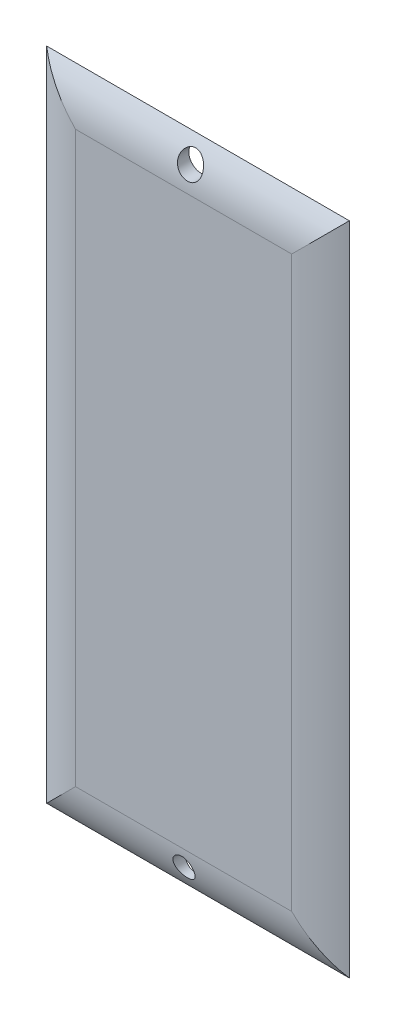
ISO-10303-21;
HEADER;
FILE_DESCRIPTION(('STEP AP214'),'2;1');
FILE_NAME('part.step','',(''),(''),'','','');
FILE_SCHEMA(('AUTOMOTIVE_DESIGN { 1 0 10303 214 1 1 1 1 }'));
ENDSEC;
DATA;
#1=APPLICATION_CONTEXT('core data for automotive mechanical design processes');
#2=APPLICATION_PROTOCOL_DEFINITION('international standard','automotive_design',2000,#1);
#3=PRODUCT_CONTEXT('',#1,'mechanical');
#4=PRODUCT('Part','Part','',(#3));
#5=PRODUCT_RELATED_PRODUCT_CATEGORY('part','',(#4));
#6=PRODUCT_DEFINITION_FORMATION('','',#4);
#7=PRODUCT_DEFINITION_CONTEXT('part definition',#1,'design');
#8=PRODUCT_DEFINITION('design','',#6,#7);
#9=PRODUCT_DEFINITION_SHAPE('','',#8);
#10=(LENGTH_UNIT() NAMED_UNIT(*) SI_UNIT(.MILLI.,.METRE.));
#11=(NAMED_UNIT(*) PLANE_ANGLE_UNIT() SI_UNIT($,.RADIAN.));
#12=(NAMED_UNIT(*) SI_UNIT($,.STERADIAN.) SOLID_ANGLE_UNIT());
#13=UNCERTAINTY_MEASURE_WITH_UNIT(LENGTH_MEASURE(1.E-05),#10,'distance_accuracy_value','');
#14=(GEOMETRIC_REPRESENTATION_CONTEXT(3) GLOBAL_UNCERTAINTY_ASSIGNED_CONTEXT((#13)) GLOBAL_UNIT_ASSIGNED_CONTEXT((#10,
#11,#12)) REPRESENTATION_CONTEXT('',''));
#15=CARTESIAN_POINT('',(0.,0.,0.));
#16=DIRECTION('',(0.,0.,1.));
#17=DIRECTION('',(1.,0.,0.));
#18=AXIS2_PLACEMENT_3D('',#15,#16,#17);
#19=CARTESIAN_POINT('',(0.,0.,2.));
#20=DIRECTION('',(0.,0.,1.));
#21=DIRECTION('',(1.,0.,0.));
#22=AXIS2_PLACEMENT_3D('',#19,#20,#21);
#23=PLANE('',#22);
#24=DIRECTION('',(0.,-1.,0.));
#25=VECTOR('',#24,1.);
#26=CARTESIAN_POINT('',(15.,45.5,2.));
#27=LINE('',#26,#25);
#28=CARTESIAN_POINT('',(15.,-39.5,2.));
#29=VERTEX_POINT('',#28);
#30=CARTESIAN_POINT('',(15.,39.5,2.));
#31=VERTEX_POINT('',#30);
#32=EDGE_CURVE('E67',#29,#31,#27,.F.);
#33=ORIENTED_EDGE('',*,*,#32,.T.);
#34=DIRECTION('',(1.,0.,0.));
#35=VECTOR('',#34,1.);
#36=CARTESIAN_POINT('',(-21.,39.5,2.));
#37=LINE('',#36,#35);
#38=CARTESIAN_POINT('',(-15.,39.5,2.));
#39=VERTEX_POINT('',#38);
#40=EDGE_CURVE('E11',#31,#39,#37,.F.);
#41=ORIENTED_EDGE('',*,*,#40,.T.);
#42=DIRECTION('',(0.,1.,0.));
#43=VECTOR('',#42,1.);
#44=CARTESIAN_POINT('',(-15.,-45.5,2.));
#45=LINE('',#44,#43);
#46=CARTESIAN_POINT('',(-15.,-39.5,2.));
#47=VERTEX_POINT('',#46);
#48=EDGE_CURVE('E52',#39,#47,#45,.F.);
#49=ORIENTED_EDGE('',*,*,#48,.T.);
#50=DIRECTION('',(-1.,0.,0.));
#51=VECTOR('',#50,1.);
#52=CARTESIAN_POINT('',(21.,-39.5,2.));
#53=LINE('',#52,#51);
#54=EDGE_CURVE('E103',#47,#29,#53,.F.);
#55=ORIENTED_EDGE('',*,*,#54,.T.);
#56=EDGE_LOOP('',(#33,#41,#49,#55));
#57=FACE_BOUND('',#56,.T.);
#58=ADVANCED_FACE('F38',(#57),#23,.T.);
#59=CARTESIAN_POINT('',(0.,0.,0.));
#60=DIRECTION('',(0.,0.,1.));
#61=DIRECTION('',(1.,0.,0.));
#62=AXIS2_PLACEMENT_3D('',#59,#60,#61);
#63=PLANE('',#62);
#64=CARTESIAN_POINT('',(-0.283052715511412,-42.0494382228283,0.));
#65=DIRECTION('',(0.,0.,1.));
#66=DIRECTION('',(1.,0.,0.));
#67=AXIS2_PLACEMENT_3D('',#64,#65,#66);
#68=CIRCLE('',#67,1.49229187540514);
#69=CARTESIAN_POINT('',(1.20923915989373,-42.0494382228283,0.));
#70=VERTEX_POINT('',#69);
#71=EDGE_CURVE('E109',#70,#70,#68,.T.);
#72=ORIENTED_EDGE('',*,*,#71,.T.);
#73=EDGE_LOOP('',(#72));
#74=FACE_BOUND('',#73,.T.);
#75=CARTESIAN_POINT('',(0.438366209458385,42.6370445816459,0.));
#76=DIRECTION('',(0.,0.,1.));
#77=DIRECTION('',(1.,0.,0.));
#78=AXIS2_PLACEMENT_3D('',#75,#76,#77);
#79=CIRCLE('',#78,1.71386303997088);
#80=CARTESIAN_POINT('',(2.15222924942926,42.6370445816459,0.));
#81=VERTEX_POINT('',#80);
#82=EDGE_CURVE('E114',#81,#81,#79,.T.);
#83=ORIENTED_EDGE('',*,*,#82,.T.);
#84=EDGE_LOOP('',(#83));
#85=FACE_BOUND('',#84,.T.);
#86=DIRECTION('',(0.,-1.,0.));
#87=VECTOR('',#86,1.);
#88=CARTESIAN_POINT('',(-21.,45.5,0.));
#89=LINE('',#88,#87);
#90=CARTESIAN_POINT('',(-21.,45.5,0.));
#91=VERTEX_POINT('',#90);
#92=CARTESIAN_POINT('',(-21.,-45.5,0.));
#93=VERTEX_POINT('',#92);
#94=EDGE_CURVE('E92',#91,#93,#89,.T.);
#95=ORIENTED_EDGE('',*,*,#94,.F.);
#96=DIRECTION('',(-1.,0.,0.));
#97=VECTOR('',#96,1.);
#98=CARTESIAN_POINT('',(-21.,45.5,0.));
#99=LINE('',#98,#97);
#100=CARTESIAN_POINT('',(21.,45.5,0.));
#101=VERTEX_POINT('',#100);
#102=EDGE_CURVE('E117',#101,#91,#99,.T.);
#103=ORIENTED_EDGE('',*,*,#102,.F.);
#104=DIRECTION('',(0.,1.,0.));
#105=VECTOR('',#104,1.);
#106=CARTESIAN_POINT('',(21.,45.5,0.));
#107=LINE('',#106,#105);
#108=CARTESIAN_POINT('',(21.,-45.5,0.));
#109=VERTEX_POINT('',#108);
#110=EDGE_CURVE('E94',#109,#101,#107,.T.);
#111=ORIENTED_EDGE('',*,*,#110,.F.);
#112=DIRECTION('',(1.,0.,0.));
#113=VECTOR('',#112,1.);
#114=CARTESIAN_POINT('',(-21.,-45.5,0.));
#115=LINE('',#114,#113);
#116=EDGE_CURVE('E87',#93,#109,#115,.T.);
#117=ORIENTED_EDGE('',*,*,#116,.F.);
#118=EDGE_LOOP('',(#95,#103,#111,#117));
#119=FACE_BOUND('',#118,.T.);
#120=ADVANCED_FACE('F89',(#74,#85,#119),#63,.F.);
#121=CARTESIAN_POINT('',(0.438366209458385,42.6370445816459,0.));
#122=DIRECTION('',(0.,0.,1.));
#123=DIRECTION('',(1.,0.,0.));
#124=AXIS2_PLACEMENT_3D('',#121,#122,#123);
#125=CYLINDRICAL_SURFACE('',#124,1.71386303997088);
#126=ORIENTED_EDGE('',*,*,#82,.F.);
#127=EDGE_LOOP('',(#126));
#128=FACE_BOUND('',#127,.T.);
#129=CARTESIAN_POINT('',(-1.2694880907903,42.49365626657,1.54138470860631));
#130=CARTESIAN_POINT('',(-1.26153018198372,42.3989003218355,1.57111384004396));
#131=CARTESIAN_POINT('',(-1.24562674473768,42.3042736289645,1.59923958893455));
#132=CARTESIAN_POINT('',(-1.19784045575203,42.1180053628231,1.65170559677611));
#133=CARTESIAN_POINT('',(-1.16595267523963,42.0263647195894,1.67604468507495));
#134=CARTESIAN_POINT('',(-1.08659773410087,41.8488337860684,1.72066739622117));
#135=CARTESIAN_POINT('',(-1.03910709419893,41.7629523983206,1.74094483258807));
#136=CARTESIAN_POINT('',(-0.929651207582571,41.5999882520282,1.77737345788032));
#137=CARTESIAN_POINT('',(-0.86768808590962,41.5229042042127,1.79352525185888));
#138=CARTESIAN_POINT('',(-0.732954614655891,41.3822344647596,1.82151732909178));
#139=CARTESIAN_POINT('',(-0.660544273149174,41.3183256211037,1.83346776620229));
#140=CARTESIAN_POINT('',(-0.505711061498358,41.2033996276326,1.85402702834544));
#141=CARTESIAN_POINT('',(-0.423288888879885,41.1523815804759,1.86263608599733));
#142=CARTESIAN_POINT('',(-0.252098142701079,41.0655280646701,1.87679292465461));
#143=CARTESIAN_POINT('',(-0.163440641072006,41.0294804846171,1.88238383624199));
#144=CARTESIAN_POINT('',(0.0187466424635544,40.972607127221,1.89101925940345));
#145=CARTESIAN_POINT('',(0.11227633881088,40.9517810826734,1.8940638156773));
#146=CARTESIAN_POINT('',(0.301370181452164,40.9260075112518,1.89781160832244));
#147=CARTESIAN_POINT('',(0.396930332548865,40.9210312696718,1.89851907882222));
#148=CARTESIAN_POINT('',(0.58753921955667,40.9270253792902,1.89765664622265));
#149=CARTESIAN_POINT('',(0.682587955224736,40.9379957380661,1.89608674204115));
#150=CARTESIAN_POINT('',(0.869505947366675,40.9755588031411,1.89055521491518));
#151=CARTESIAN_POINT('',(0.961374202697005,41.0021563820317,1.88659284598582));
#152=CARTESIAN_POINT('',(1.13928806277195,41.0701673604568,1.87601899644375));
#153=CARTESIAN_POINT('',(1.22533377348076,41.1115804902775,1.86940756405638));
#154=CARTESIAN_POINT('',(1.38913760455742,41.2079242029855,1.85319086006218));
#155=CARTESIAN_POINT('',(1.46689868867383,41.2628499284397,1.84358666394745));
#156=CARTESIAN_POINT('',(1.61200060169092,41.3844984502633,1.82102240456898));
#157=CARTESIAN_POINT('',(1.67934174291585,41.4512208929129,1.80806244192111));
#158=CARTESIAN_POINT('',(1.80196287016079,41.5945258782606,1.77846182958802));
#159=CARTESIAN_POINT('',(1.85721324149649,41.6711319165247,1.76181233910156));
#160=CARTESIAN_POINT('',(1.954111038298,41.8316648684332,1.72471688287746));
#161=CARTESIAN_POINT('',(1.99575792692562,41.9155920708293,1.70427076736242));
#162=CARTESIAN_POINT('',(2.06519294481537,42.0896152303449,1.65930074391825));
#163=CARTESIAN_POINT('',(2.09274693022936,42.1797888003737,1.63471643331315));
#164=CARTESIAN_POINT('',(2.13266823341674,42.3624329181035,1.58204131676535));
#165=CARTESIAN_POINT('',(2.14503280255299,42.4549038784464,1.55394987719461));
#166=CARTESIAN_POINT('',(2.15491875783667,42.6434274238081,1.49363186782823));
#167=CARTESIAN_POINT('',(2.15181871363539,42.7394733890218,1.46128390218905));
#168=CARTESIAN_POINT('',(2.12988442949902,42.9289258695292,1.39428427636494));
#169=CARTESIAN_POINT('',(2.11104561916391,43.0223316099784,1.35963194970434));
#170=CARTESIAN_POINT('',(2.0569181324665,43.2094267635442,1.28712916463769));
#171=CARTESIAN_POINT('',(2.02076920758398,43.3028404641393,1.24920819231005));
#172=CARTESIAN_POINT('',(1.93277806443218,43.4820486341403,1.17348166929994));
#173=CARTESIAN_POINT('',(1.88093008047817,43.5678402892522,1.1356761661864));
#174=CARTESIAN_POINT('',(1.76082185156981,43.7320776706837,1.06078967604263));
#175=CARTESIAN_POINT('',(1.69211158125293,43.8102217341544,1.02376542685404));
#176=CARTESIAN_POINT('',(1.54053423131094,43.9536421506632,0.95385092818028));
#177=CARTESIAN_POINT('',(1.45766921186868,44.0189203733134,0.920960078298266));
#178=CARTESIAN_POINT('',(1.28399905156737,44.1311637933591,0.863189273794485));
#179=CARTESIAN_POINT('',(1.19377790371136,44.1788665966893,0.837996961731));
#180=CARTESIAN_POINT('',(1.00468075903184,44.2578711221297,0.795720208623415));
#181=CARTESIAN_POINT('',(0.905815053478656,44.2891920446194,0.778626278098076));
#182=CARTESIAN_POINT('',(0.714862815996774,44.3309392958975,0.755713794657179));
#183=CARTESIAN_POINT('',(0.623348255584759,44.3433912377296,0.748804820499371));
#184=CARTESIAN_POINT('',(0.439274519875648,44.3533797494278,0.743268596177895));
#185=CARTESIAN_POINT('',(0.346715893285552,44.35092382004,0.744637181241907));
#186=CARTESIAN_POINT('',(0.171045306705465,44.3320504850839,0.755077440352523));
#187=CARTESIAN_POINT('',(0.0877699959279362,44.3167657351788,0.763524097507696));
#188=CARTESIAN_POINT('',(-0.0748110185664154,44.2744308308414,0.786659617945085));
#189=CARTESIAN_POINT('',(-0.154116281883922,44.2473793743333,0.801349172047317));
#190=CARTESIAN_POINT('',(-0.309371373455119,44.1815668785654,0.836535433354569));
#191=CARTESIAN_POINT('',(-0.385137354318301,44.1424644760444,0.857200174591529));
#192=CARTESIAN_POINT('',(-0.529123149449504,44.0542348964765,0.902887681350275));
#193=CARTESIAN_POINT('',(-0.597340290152929,44.005104185127,0.927911982866321));
#194=CARTESIAN_POINT('',(-0.731989581771854,43.8924699221986,0.983905714318799));
#195=CARTESIAN_POINT('',(-0.797462945676342,43.8279941319286,1.01522427554312));
#196=CARTESIAN_POINT('',(-0.916889007281515,43.6901065882835,1.08013314356217));
#197=CARTESIAN_POINT('',(-0.970834265705419,43.616689112371,1.1137248989903));
#198=CARTESIAN_POINT('',(-1.07114572906523,43.4547612048004,1.18523025379534));
#199=CARTESIAN_POINT('',(-1.11619733862108,43.3654753334274,1.22323784776691));
#200=CARTESIAN_POINT('',(-1.19017954827926,43.1802746472291,1.29868584406647));
#201=CARTESIAN_POINT('',(-1.21911807574007,43.0843631182676,1.33612651647416));
#202=CARTESIAN_POINT('',(-1.25623266150065,42.906086843101,1.4024422994034));
#203=CARTESIAN_POINT('',(-1.26722160650763,42.8244183403806,1.43163975545412));
#204=CARTESIAN_POINT('',(-1.27733227131025,42.6596854782622,1.48809591051951));
#205=CARTESIAN_POINT('',(-1.27645576341737,42.5766213291793,1.51535489846662));
#206=CARTESIAN_POINT('',(-1.2694880907903,42.49365626657,1.54138470860631));
#207=B_SPLINE_CURVE_WITH_KNOTS('',3,(#129,#130,#131,#132,#133,#134,#135,#136,#137,#138,#139,
#140,#141,#142,#143,#144,#145,#146,#147,#148,#149,#150,#151,#152,#153,#154,#155,#156,#157,#158,
#159,#160,#161,#162,#163,#164,#165,#166,#167,#168,#169,#170,#171,#172,#173,#174,#175,#176,#177,
#178,#179,#180,#181,#182,#183,#184,#185,#186,#187,#188,#189,#190,#191,#192,#193,#194,#195,#196,
#197,#198,#199,#200,#201,#202,#203,#204,#205,#206),.UNSPECIFIED.,.T.,.F.,(4,2,2,2,2,2,2,2,2,2,2,
2,2,2,2,2,2,2,2,2,2,2,2,2,2,2,2,2,2,2,2,2,2,2,2,2,2,2,4),(0.,0.298593101178735,
0.597278330239308,0.896415097150986,1.19550796842231,1.48604182387192,1.77655544938577,
2.0627995439609,2.34903861358211,2.63475881494551,2.92047915207803,3.20628862457012,
3.49209289423037,3.77779457428893,4.06348768915111,4.34987292657913,4.63626946434601,
4.92728117918832,5.21834554699793,5.52119803002811,5.8241384893517,6.14400421185935,
6.46398755201913,6.79367446523955,7.12331343430449,7.43688295250223,7.75008412337134,
8.02641648554387,8.30260982538234,8.55670732051395,8.81083294062681,9.07294709288577,
9.33515378270721,9.62520421547768,9.91544126111197,10.2349736360876,10.5543486674279,
10.8158256244954,11.0772635258686),.UNSPECIFIED.);
#208=CARTESIAN_POINT('',(-1.2694880907903,42.49365626657,1.54138470860631));
#209=VERTEX_POINT('',#208);
#210=EDGE_CURVE('E124',#209,#209,#207,.T.);
#211=ORIENTED_EDGE('',*,*,#210,.T.);
#212=EDGE_LOOP('',(#211));
#213=FACE_BOUND('',#212,.T.);
#214=ADVANCED_FACE('F135',(#128,#213),#125,.F.);
#215=CARTESIAN_POINT('',(-0.283052715511412,-42.0494382228283,0.));
#216=DIRECTION('',(0.,0.,1.));
#217=DIRECTION('',(1.,0.,0.));
#218=AXIS2_PLACEMENT_3D('',#215,#216,#217);
#219=CYLINDRICAL_SURFACE('',#218,1.49229187540514);
#220=ORIENTED_EDGE('',*,*,#71,.F.);
#221=EDGE_LOOP('',(#220));
#222=FACE_BOUND('',#221,.T.);
#223=CARTESIAN_POINT('',(-1.77325630196904,-41.9705185655241,1.6900226014907));
#224=CARTESIAN_POINT('',(-1.77787522773525,-42.057808601197,1.66776567217924));
#225=CARTESIAN_POINT('',(-1.77479363607448,-42.1452425229327,1.64420574367611));
#226=CARTESIAN_POINT('',(-1.75359402358012,-42.3178099999724,1.59520841609931));
#227=CARTESIAN_POINT('',(-1.73545398894704,-42.40293999894,1.56976831805355));
#228=CARTESIAN_POINT('',(-1.6848674098572,-42.5683992826645,1.5180054443282));
#229=CARTESIAN_POINT('',(-1.65244280803552,-42.6487357167773,1.49168407944791));
#230=CARTESIAN_POINT('',(-1.57420157577262,-42.802646790191,1.43923411664933));
#231=CARTESIAN_POINT('',(-1.5283871875844,-42.8762225589233,1.41310548720605));
#232=CARTESIAN_POINT('',(-1.4236757820249,-43.0156815878106,1.36192203610938));
#233=CARTESIAN_POINT('',(-1.36459830869599,-43.0814375108686,1.33688833906894));
#234=CARTESIAN_POINT('',(-1.23511414020531,-43.2019715308386,1.28975797020894));
#235=CARTESIAN_POINT('',(-1.16470840522331,-43.2567505572658,1.26766104975875));
#236=CARTESIAN_POINT('',(-1.01696100197351,-43.3516483365334,1.22861611200182));
#237=CARTESIAN_POINT('',(-0.939945580690155,-43.3922105718949,1.21151579143211));
#238=CARTESIAN_POINT('',(-0.779164123563363,-43.4595409758956,1.18277673764767));
#239=CARTESIAN_POINT('',(-0.695402566201802,-43.4863182099512,1.17113441554628));
#240=CARTESIAN_POINT('',(-0.530569775856424,-43.5232904924553,1.15497185106211));
#241=CARTESIAN_POINT('',(-0.449799344486347,-43.5346172826311,1.1499663862882));
#242=CARTESIAN_POINT('',(-0.287354258211597,-43.5439374498523,1.14585153745442));
#243=CARTESIAN_POINT('',(-0.205679931620991,-43.5419355191274,1.14674007847414));
#244=CARTESIAN_POINT('',(-0.0483007583133034,-43.5251619425864,1.1541325688117));
#245=CARTESIAN_POINT('',(0.0274919942044553,-43.5110680939105,1.16033843802494));
#246=CARTESIAN_POINT('',(0.175501935496165,-43.471595157178,1.17752096360101));
#247=CARTESIAN_POINT('',(0.247718853409352,-43.4462152156762,1.18849798075275));
#248=CARTESIAN_POINT('',(0.388284069148614,-43.3844515414608,1.21478048663731));
#249=CARTESIAN_POINT('',(0.45651896454333,-43.3478474701849,1.23017220811403));
#250=CARTESIAN_POINT('',(0.585959245941772,-43.2650295396492,1.26426218801152));
#251=CARTESIAN_POINT('',(0.647162546684887,-43.2188128410693,1.28296142314114));
#252=CARTESIAN_POINT('',(0.765501573133834,-43.1143959836767,1.32413567709155));
#253=CARTESIAN_POINT('',(0.822026053541081,-43.0555721477717,1.34678570798984));
#254=CARTESIAN_POINT('',(0.924546063781358,-42.9299051370913,1.39362803083593));
#255=CARTESIAN_POINT('',(0.970537882391396,-42.8630591482851,1.4178208625685));
#256=CARTESIAN_POINT('',(1.0537022762042,-42.7183413239595,1.46829017330096));
#257=CARTESIAN_POINT('',(1.09009966403447,-42.640034049318,1.49459932249948));
#258=CARTESIAN_POINT('',(1.14892828584875,-42.47813964517,1.54661782987057));
#259=CARTESIAN_POINT('',(1.17135760079345,-42.3945517919144,1.57232710516113));
#260=CARTESIAN_POINT('',(1.20171843936543,-42.2229326272846,1.62256467745086));
#261=CARTESIAN_POINT('',(1.20941406788615,-42.1348518308564,1.64706773544439));
#262=CARTESIAN_POINT('',(1.20905831011165,-41.9580690062845,1.69361884358266));
#263=CARTESIAN_POINT('',(1.2010095816932,-41.8693670855145,1.71566730743454));
#264=CARTESIAN_POINT('',(1.16952586792672,-41.6966986282593,1.75613411013118));
#265=CARTESIAN_POINT('',(1.14654760522155,-41.6126694657838,1.7746397350657));
#266=CARTESIAN_POINT('',(1.08603787763942,-41.4493514757652,1.80851593180026));
#267=CARTESIAN_POINT('',(1.04850959863452,-41.370061614888,1.82388718877808));
#268=CARTESIAN_POINT('',(0.96149114913646,-41.221689269694,1.85095290430949));
#269=CARTESIAN_POINT('',(0.912495262379789,-41.1523375668061,1.86276241585119));
#270=CARTESIAN_POINT('',(0.803205218008652,-41.0227140560511,1.88360553367832));
#271=CARTESIAN_POINT('',(0.742912327695887,-40.9624412310791,1.89263945103106));
#272=CARTESIAN_POINT('',(0.614048857664614,-40.853989665788,1.90806048075222));
#273=CARTESIAN_POINT('',(0.545664733644988,-40.8055960759182,1.91449622622746));
#274=CARTESIAN_POINT('',(0.401646728202916,-40.7208672081299,1.92528661741566));
#275=CARTESIAN_POINT('',(0.32601306168296,-40.6845315729129,1.92964132479518));
#276=CARTESIAN_POINT('',(0.169994498057178,-40.6251413518821,1.93654630516151));
#277=CARTESIAN_POINT('',(0.0896311922411316,-40.6020308999464,1.93910417896136));
#278=CARTESIAN_POINT('',(-0.073857697636236,-40.5695332833249,1.94265401813493));
#279=CARTESIAN_POINT('',(-0.156983292762253,-40.5601461736163,1.94364597723541));
#280=CARTESIAN_POINT('',(-0.323691089079735,-40.5553694651466,1.94415414200368));
#281=CARTESIAN_POINT('',(-0.407273538408699,-40.5599884296196,1.94366944485139));
#282=CARTESIAN_POINT('',(-0.572473370217247,-40.583107088159,1.94117759027417));
#283=CARTESIAN_POINT('',(-0.654090748448578,-40.6016068122313,1.93917042955814));
#284=CARTESIAN_POINT('',(-0.813055556466634,-40.6519461879603,1.93346147650092));
#285=CARTESIAN_POINT('',(-0.890402265908755,-40.6837880823428,1.9297593992464));
#286=CARTESIAN_POINT('',(-1.03860788762316,-40.7598612764112,1.92039369399368));
#287=CARTESIAN_POINT('',(-1.10946714152601,-40.8040919232046,1.91473016936086));
#288=CARTESIAN_POINT('',(-1.24263958025533,-40.9035631692739,1.90113730889777));
#289=CARTESIAN_POINT('',(-1.30496004369264,-40.9587942917555,1.89320992082944));
#290=CARTESIAN_POINT('',(-1.41940990229055,-41.0786180021461,1.87479773182957));
#291=CARTESIAN_POINT('',(-1.47153738962251,-41.1432123386443,1.86431245295914));
#292=CARTESIAN_POINT('',(-1.56432278457643,-41.2799398665053,1.84056077649557));
#293=CARTESIAN_POINT('',(-1.60495190261112,-41.3520913719797,1.82728754053318));
#294=CARTESIAN_POINT('',(-1.67356746917122,-41.5015739283337,1.7979325550553));
#295=CARTESIAN_POINT('',(-1.70156621820738,-41.5788998552609,1.7818535592855));
#296=CARTESIAN_POINT('',(-1.73696006626687,-41.7089643676681,1.75311497023581));
#297=CARTESIAN_POINT('',(-1.74813511562602,-41.7608778217817,1.74121718627901));
#298=CARTESIAN_POINT('',(-1.76489126545679,-41.8653496211852,1.71637823674627));
#299=CARTESIAN_POINT('',(-1.77047242769781,-41.9179079593476,1.70343708269324));
#300=CARTESIAN_POINT('',(-1.77325630196904,-41.9705185655241,1.6900226014907));
#301=B_SPLINE_CURVE_WITH_KNOTS('',3,(#223,#224,#225,#226,#227,#228,#229,#230,#231,#232,#233,
#234,#235,#236,#237,#238,#239,#240,#241,#242,#243,#244,#245,#246,#247,#248,#249,#250,#251,#252,
#253,#254,#255,#256,#257,#258,#259,#260,#261,#262,#263,#264,#265,#266,#267,#268,#269,#270,#271,
#272,#273,#274,#275,#276,#277,#278,#279,#280,#281,#282,#283,#284,#285,#286,#287,#288,#289,#290,
#291,#292,#293,#294,#295,#296,#297,#298,#299,#300),.UNSPECIFIED.,.T.,.F.,(4,2,2,2,2,2,2,2,2,2,2,
2,2,2,2,2,2,2,2,2,2,2,2,2,2,2,2,2,2,2,2,2,2,2,2,2,2,2,4),(0.,0.270399342458055,
0.541194676804617,0.811575482906047,1.08191103696838,1.356175434624,1.63041659795211,
1.89512315242111,2.15965540509611,2.40352760955983,2.64731396603308,2.87826643117358,
3.10923636372226,3.34506715962588,3.58096771298938,3.83387327980477,4.08686782220919,
4.35643709511357,4.62604339531424,4.89993129316075,5.17377295873146,5.43960840915293,
5.7053856850783,5.96132347618858,6.21723257328163,6.46810059387061,6.71896118012857,
6.96875410097566,7.2185480225202,7.46849469743312,7.71844191265298,7.96843115911959,
8.21840723352715,8.46816888046096,8.71797723085643,8.96840562620033,9.21858960407569,
9.38156388053952,9.54453635737238),.UNSPECIFIED.);
#302=CARTESIAN_POINT('',(-1.77325630196904,-41.9705185655241,1.6900226014907));
#303=VERTEX_POINT('',#302);
#304=EDGE_CURVE('E43',#303,#303,#301,.T.);
#305=ORIENTED_EDGE('',*,*,#304,.T.);
#306=EDGE_LOOP('',(#305));
#307=FACE_BOUND('',#306,.T.);
#308=ADVANCED_FACE('F139',(#222,#307),#219,.F.);
#309=CARTESIAN_POINT('',(-21.,-39.5,-8.));
#310=DIRECTION('',(1.,0.,0.));
#311=DIRECTION('',(0.,0.,-1.));
#312=AXIS2_PLACEMENT_3D('',#309,#310,#311);
#313=CYLINDRICAL_SURFACE('',#312,10.);
#314=CARTESIAN_POINT('',(-15.,-39.5,-8.));
#315=DIRECTION('',(0.707106781186547,-0.707106781186547,0.));
#316=DIRECTION('',(0.707106781186547,0.707106781186548,0.));
#317=AXIS2_PLACEMENT_3D('',#314,#315,#316);
#318=ELLIPSE('',#317,14.1421356237309,10.);
#319=EDGE_CURVE('E101',#93,#47,#318,.F.);
#320=ORIENTED_EDGE('',*,*,#319,.F.);
#321=ORIENTED_EDGE('',*,*,#116,.T.);
#322=CARTESIAN_POINT('',(15.,-39.5,-8.));
#323=DIRECTION('',(0.707106781186547,0.707106781186547,0.));
#324=DIRECTION('',(0.707106781186547,-0.707106781186547,0.));
#325=AXIS2_PLACEMENT_3D('',#322,#323,#324);
#326=ELLIPSE('',#325,14.1421356237309,10.);
#327=EDGE_CURVE('E105',#29,#109,#326,.T.);
#328=ORIENTED_EDGE('',*,*,#327,.F.);
#329=ORIENTED_EDGE('',*,*,#54,.F.);
#330=EDGE_LOOP('',(#320,#321,#328,#329));
#331=FACE_BOUND('',#330,.T.);
#332=ORIENTED_EDGE('',*,*,#304,.F.);
#333=EDGE_LOOP('',(#332));
#334=FACE_BOUND('',#333,.T.);
#335=ADVANCED_FACE('F40',(#331,#334),#313,.T.);
#336=CARTESIAN_POINT('',(15.,45.5,-8.));
#337=DIRECTION('',(0.,1.,0.));
#338=DIRECTION('',(0.,0.,1.));
#339=AXIS2_PLACEMENT_3D('',#336,#337,#338);
#340=CYLINDRICAL_SURFACE('',#339,10.);
#341=ORIENTED_EDGE('',*,*,#327,.T.);
#342=ORIENTED_EDGE('',*,*,#110,.T.);
#343=CARTESIAN_POINT('',(15.,39.5,-8.));
#344=DIRECTION('',(-0.707106781186547,0.707106781186547,0.));
#345=DIRECTION('',(0.707106781186547,0.707106781186547,0.));
#346=AXIS2_PLACEMENT_3D('',#343,#344,#345);
#347=ELLIPSE('',#346,14.1421356237309,10.);
#348=EDGE_CURVE('E106',#31,#101,#347,.T.);
#349=ORIENTED_EDGE('',*,*,#348,.F.);
#350=ORIENTED_EDGE('',*,*,#32,.F.);
#351=EDGE_LOOP('',(#341,#342,#349,#350));
#352=FACE_BOUND('',#351,.T.);
#353=ADVANCED_FACE('F155',(#352),#340,.T.);
#354=CARTESIAN_POINT('',(-15.,45.5,-8.));
#355=DIRECTION('',(0.,-1.,0.));
#356=DIRECTION('',(1.,0.,0.));
#357=AXIS2_PLACEMENT_3D('',#354,#355,#356);
#358=CYLINDRICAL_SURFACE('',#357,10.);
#359=ORIENTED_EDGE('',*,*,#319,.T.);
#360=ORIENTED_EDGE('',*,*,#48,.F.);
#361=CARTESIAN_POINT('',(-15.,39.5,-8.));
#362=DIRECTION('',(-0.707106781186547,-0.707106781186548,0.));
#363=DIRECTION('',(0.707106781186547,-0.707106781186547,0.));
#364=AXIS2_PLACEMENT_3D('',#361,#362,#363);
#365=ELLIPSE('',#364,14.142135623731,10.);
#366=EDGE_CURVE('E60',#91,#39,#365,.F.);
#367=ORIENTED_EDGE('',*,*,#366,.F.);
#368=ORIENTED_EDGE('',*,*,#94,.T.);
#369=EDGE_LOOP('',(#359,#360,#367,#368));
#370=FACE_BOUND('',#369,.T.);
#371=ADVANCED_FACE('F108',(#370),#358,.T.);
#372=CARTESIAN_POINT('',(-21.,39.5,-8.));
#373=DIRECTION('',(-1.,0.,0.));
#374=DIRECTION('',(0.,0.,1.));
#375=AXIS2_PLACEMENT_3D('',#372,#373,#374);
#376=CYLINDRICAL_SURFACE('',#375,10.);
#377=ORIENTED_EDGE('',*,*,#348,.T.);
#378=ORIENTED_EDGE('',*,*,#102,.T.);
#379=ORIENTED_EDGE('',*,*,#366,.T.);
#380=ORIENTED_EDGE('',*,*,#40,.F.);
#381=EDGE_LOOP('',(#377,#378,#379,#380));
#382=FACE_BOUND('',#381,.T.);
#383=ORIENTED_EDGE('',*,*,#210,.F.);
#384=EDGE_LOOP('',(#383));
#385=FACE_BOUND('',#384,.T.);
#386=ADVANCED_FACE('F131',(#382,#385),#376,.T.);
#387=CLOSED_SHELL('',(#58,#120,#214,#308,#335,#353,#371,#386));
#388=MANIFOLD_SOLID_BREP('B2',#387);
#389=ADVANCED_BREP_SHAPE_REPRESENTATION('',(#18,#388),#14);
#390=SHAPE_DEFINITION_REPRESENTATION(#9,#389);
ENDSEC;
END-ISO-10303-21;
